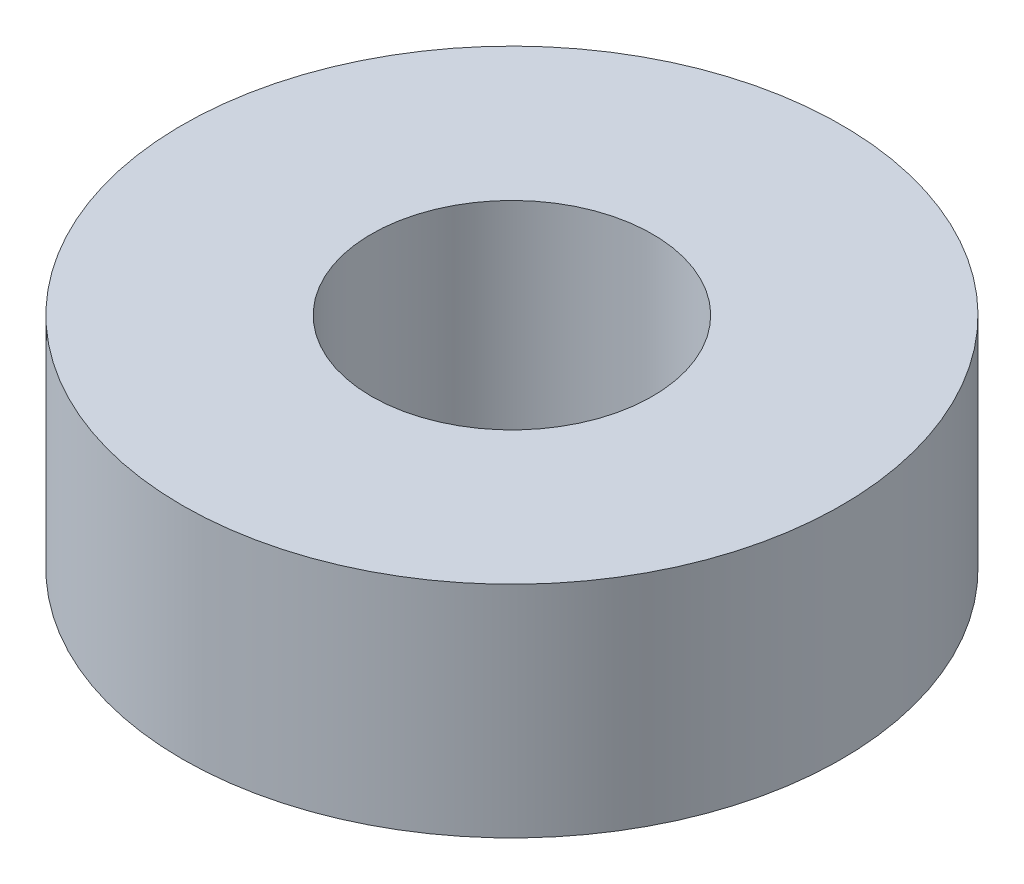
ISO-10303-21;
HEADER;
FILE_DESCRIPTION(('STEP AP214'),'2;1');
FILE_NAME('part.step','',(''),(''),'','','');
FILE_SCHEMA(('AUTOMOTIVE_DESIGN { 1 0 10303 214 1 1 1 1 }'));
ENDSEC;
DATA;
#1=APPLICATION_CONTEXT('core data for automotive mechanical design processes');
#2=APPLICATION_PROTOCOL_DEFINITION('international standard','automotive_design',2000,#1);
#3=PRODUCT_CONTEXT('',#1,'mechanical');
#4=PRODUCT('Part','Part','',(#3));
#5=PRODUCT_RELATED_PRODUCT_CATEGORY('part','',(#4));
#6=PRODUCT_DEFINITION_FORMATION('','',#4);
#7=PRODUCT_DEFINITION_CONTEXT('part definition',#1,'design');
#8=PRODUCT_DEFINITION('design','',#6,#7);
#9=PRODUCT_DEFINITION_SHAPE('','',#8);
#10=(LENGTH_UNIT() NAMED_UNIT(*) SI_UNIT(.MILLI.,.METRE.));
#11=(NAMED_UNIT(*) PLANE_ANGLE_UNIT() SI_UNIT($,.RADIAN.));
#12=(NAMED_UNIT(*) SI_UNIT($,.STERADIAN.) SOLID_ANGLE_UNIT());
#13=UNCERTAINTY_MEASURE_WITH_UNIT(LENGTH_MEASURE(1.E-05),#10,'distance_accuracy_value','');
#14=(GEOMETRIC_REPRESENTATION_CONTEXT(3) GLOBAL_UNCERTAINTY_ASSIGNED_CONTEXT((#13)) GLOBAL_UNIT_ASSIGNED_CONTEXT((#10,
#11,#12)) REPRESENTATION_CONTEXT('',''));
#15=CARTESIAN_POINT('',(0.,0.,0.));
#16=DIRECTION('',(0.,0.,1.));
#17=DIRECTION('',(1.,0.,0.));
#18=AXIS2_PLACEMENT_3D('',#15,#16,#17);
#19=CARTESIAN_POINT('',(0.,10.16,0.));
#20=DIRECTION('',(0.,-1.,0.));
#21=DIRECTION('',(0.,0.,-1.));
#22=AXIS2_PLACEMENT_3D('',#19,#20,#21);
#23=CYLINDRICAL_SURFACE('',#22,6.5);
#24=CARTESIAN_POINT('',(0.,10.16,0.));
#25=DIRECTION('',(0.,1.,0.));
#26=DIRECTION('',(0.,0.,1.));
#27=AXIS2_PLACEMENT_3D('',#24,#25,#26);
#28=CIRCLE('',#27,6.5);
#29=CARTESIAN_POINT('',(0.,10.16,6.5));
#30=VERTEX_POINT('',#29);
#31=EDGE_CURVE('E42',#30,#30,#28,.T.);
#32=ORIENTED_EDGE('',*,*,#31,.T.);
#33=EDGE_LOOP('',(#32));
#34=FACE_BOUND('',#33,.T.);
#35=CARTESIAN_POINT('',(0.,0.,0.));
#36=DIRECTION('',(0.,1.,0.));
#37=DIRECTION('',(0.,0.,1.));
#38=AXIS2_PLACEMENT_3D('',#35,#36,#37);
#39=CIRCLE('',#38,6.5);
#40=CARTESIAN_POINT('',(0.,0.,6.5));
#41=VERTEX_POINT('',#40);
#42=EDGE_CURVE('E48',#41,#41,#39,.T.);
#43=ORIENTED_EDGE('',*,*,#42,.F.);
#44=EDGE_LOOP('',(#43));
#45=FACE_BOUND('',#44,.T.);
#46=ADVANCED_FACE('F35',(#34,#45),#23,.F.);
#47=CARTESIAN_POINT('',(0.,10.16,0.));
#48=DIRECTION('',(0.,-1.,0.));
#49=DIRECTION('',(0.,0.,-1.));
#50=AXIS2_PLACEMENT_3D('',#47,#48,#49);
#51=CYLINDRICAL_SURFACE('',#50,15.24);
#52=CARTESIAN_POINT('',(0.,10.16,0.));
#53=DIRECTION('',(0.,1.,0.));
#54=DIRECTION('',(0.,0.,1.));
#55=AXIS2_PLACEMENT_3D('',#52,#53,#54);
#56=CIRCLE('',#55,15.24);
#57=CARTESIAN_POINT('',(0.,10.16,15.24));
#58=VERTEX_POINT('',#57);
#59=EDGE_CURVE('E10',#58,#58,#56,.T.);
#60=ORIENTED_EDGE('',*,*,#59,.F.);
#61=EDGE_LOOP('',(#60));
#62=FACE_BOUND('',#61,.T.);
#63=CARTESIAN_POINT('',(0.,0.,0.));
#64=DIRECTION('',(0.,1.,0.));
#65=DIRECTION('',(0.,0.,1.));
#66=AXIS2_PLACEMENT_3D('',#63,#64,#65);
#67=CIRCLE('',#66,15.24);
#68=CARTESIAN_POINT('',(0.,0.,15.24));
#69=VERTEX_POINT('',#68);
#70=EDGE_CURVE('E38',#69,#69,#67,.T.);
#71=ORIENTED_EDGE('',*,*,#70,.T.);
#72=EDGE_LOOP('',(#71));
#73=FACE_BOUND('',#72,.T.);
#74=ADVANCED_FACE('F55',(#62,#73),#51,.T.);
#75=CARTESIAN_POINT('',(0.,10.16,0.));
#76=DIRECTION('',(0.,1.,0.));
#77=DIRECTION('',(0.,0.,1.));
#78=AXIS2_PLACEMENT_3D('',#75,#76,#77);
#79=PLANE('',#78);
#80=ORIENTED_EDGE('',*,*,#31,.F.);
#81=EDGE_LOOP('',(#80));
#82=FACE_BOUND('',#81,.T.);
#83=ORIENTED_EDGE('',*,*,#59,.T.);
#84=EDGE_LOOP('',(#83));
#85=FACE_BOUND('',#84,.T.);
#86=ADVANCED_FACE('F59',(#82,#85),#79,.T.);
#87=CARTESIAN_POINT('',(0.,0.,0.));
#88=DIRECTION('',(0.,1.,0.));
#89=DIRECTION('',(0.,0.,1.));
#90=AXIS2_PLACEMENT_3D('',#87,#88,#89);
#91=PLANE('',#90);
#92=ORIENTED_EDGE('',*,*,#42,.T.);
#93=EDGE_LOOP('',(#92));
#94=FACE_BOUND('',#93,.T.);
#95=ORIENTED_EDGE('',*,*,#70,.F.);
#96=EDGE_LOOP('',(#95));
#97=FACE_BOUND('',#96,.T.);
#98=ADVANCED_FACE('F57',(#94,#97),#91,.F.);
#99=CLOSED_SHELL('',(#46,#74,#86,#98));
#100=MANIFOLD_SOLID_BREP('B2',#99);
#101=ADVANCED_BREP_SHAPE_REPRESENTATION('',(#18,#100),#14);
#102=SHAPE_DEFINITION_REPRESENTATION(#9,#101);
ENDSEC;
END-ISO-10303-21;
